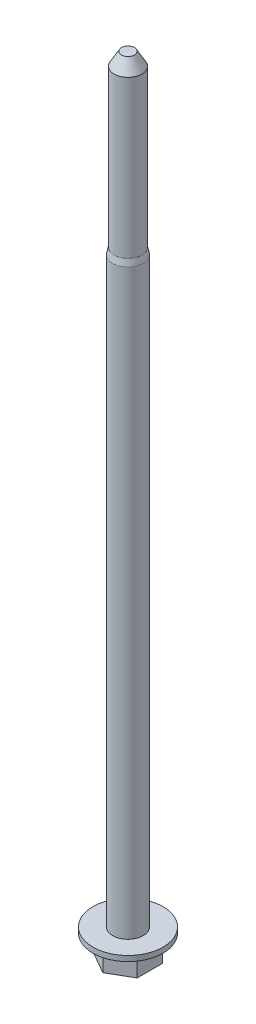
ISO-10303-21;
HEADER;
FILE_DESCRIPTION(('STEP AP214'),'2;1');
FILE_NAME('part.step','',(''),(''),'','','');
FILE_SCHEMA(('AUTOMOTIVE_DESIGN { 1 0 10303 214 1 1 1 1 }'));
ENDSEC;
DATA;
#1=APPLICATION_CONTEXT('core data for automotive mechanical design processes');
#2=APPLICATION_PROTOCOL_DEFINITION('international standard','automotive_design',2000,#1);
#3=PRODUCT_CONTEXT('',#1,'mechanical');
#4=PRODUCT('Part','Part','',(#3));
#5=PRODUCT_RELATED_PRODUCT_CATEGORY('part','',(#4));
#6=PRODUCT_DEFINITION_FORMATION('','',#4);
#7=PRODUCT_DEFINITION_CONTEXT('part definition',#1,'design');
#8=PRODUCT_DEFINITION('design','',#6,#7);
#9=PRODUCT_DEFINITION_SHAPE('','',#8);
#10=(LENGTH_UNIT() NAMED_UNIT(*) SI_UNIT(.MILLI.,.METRE.));
#11=(NAMED_UNIT(*) PLANE_ANGLE_UNIT() SI_UNIT($,.RADIAN.));
#12=(NAMED_UNIT(*) SI_UNIT($,.STERADIAN.) SOLID_ANGLE_UNIT());
#13=UNCERTAINTY_MEASURE_WITH_UNIT(LENGTH_MEASURE(1.E-05),#10,'distance_accuracy_value','');
#14=(GEOMETRIC_REPRESENTATION_CONTEXT(3) GLOBAL_UNCERTAINTY_ASSIGNED_CONTEXT((#13)) GLOBAL_UNIT_ASSIGNED_CONTEXT((#10,
#11,#12)) REPRESENTATION_CONTEXT('',''));
#15=CARTESIAN_POINT('',(0.,0.,0.));
#16=DIRECTION('',(0.,0.,1.));
#17=DIRECTION('',(1.,0.,0.));
#18=AXIS2_PLACEMENT_3D('',#15,#16,#17);
#19=CARTESIAN_POINT('',(0.,96.23,0.));
#20=DIRECTION('',(0.,1.,0.));
#21=DIRECTION('',(0.,0.,1.));
#22=AXIS2_PLACEMENT_3D('',#19,#20,#21);
#23=PLANE('',#22);
#24=CARTESIAN_POINT('',(0.,96.23,0.));
#25=DIRECTION('',(0.,1.,0.));
#26=DIRECTION('',(0.,0.,1.));
#27=AXIS2_PLACEMENT_3D('',#24,#25,#26);
#28=CIRCLE('',#27,2.17244343832996);
#29=CARTESIAN_POINT('',(0.,96.23,2.17244343832996));
#30=VERTEX_POINT('',#29);
#31=EDGE_CURVE('E41',#30,#30,#28,.T.);
#32=ORIENTED_EDGE('',*,*,#31,.T.);
#33=EDGE_LOOP('',(#32));
#34=FACE_BOUND('',#33,.T.);
#35=CARTESIAN_POINT('',(0.,96.23,0.));
#36=DIRECTION('',(0.,1.,0.));
#37=DIRECTION('',(0.,0.,1.));
#38=AXIS2_PLACEMENT_3D('',#35,#36,#37);
#39=CIRCLE('',#38,2.165);
#40=CARTESIAN_POINT('',(0.,96.23,2.165));
#41=VERTEX_POINT('',#40);
#42=EDGE_CURVE('E218',#41,#41,#39,.T.);
#43=ORIENTED_EDGE('',*,*,#42,.F.);
#44=EDGE_LOOP('',(#43));
#45=FACE_BOUND('',#44,.T.);
#46=ADVANCED_FACE('F32',(#34,#45),#23,.T.);
#47=CARTESIAN_POINT('',(0.,4.23,0.));
#48=DIRECTION('',(0.,1.,0.));
#49=DIRECTION('',(0.,0.,1.));
#50=AXIS2_PLACEMENT_3D('',#47,#48,#49);
#51=PLANE('',#50);
#52=CARTESIAN_POINT('',(0.,4.23,0.));
#53=DIRECTION('',(0.,1.,0.));
#54=DIRECTION('',(0.,0.,1.));
#55=AXIS2_PLACEMENT_3D('',#52,#53,#54);
#56=CIRCLE('',#55,5.48);
#57=CARTESIAN_POINT('',(0.,4.23,5.48));
#58=VERTEX_POINT('',#57);
#59=EDGE_CURVE('E130',#58,#58,#56,.T.);
#60=ORIENTED_EDGE('',*,*,#59,.T.);
#61=EDGE_LOOP('',(#60));
#62=FACE_BOUND('',#61,.T.);
#63=CARTESIAN_POINT('',(0.,4.23,0.));
#64=DIRECTION('',(0.,1.,0.));
#65=DIRECTION('',(0.,0.,1.));
#66=AXIS2_PLACEMENT_3D('',#63,#64,#65);
#67=CIRCLE('',#66,2.385);
#68=CARTESIAN_POINT('',(0.,4.23,2.385));
#69=VERTEX_POINT('',#68);
#70=EDGE_CURVE('E213',#69,#69,#67,.T.);
#71=ORIENTED_EDGE('',*,*,#70,.F.);
#72=EDGE_LOOP('',(#71));
#73=FACE_BOUND('',#72,.T.);
#74=ADVANCED_FACE('F163',(#62,#73),#51,.T.);
#75=CARTESIAN_POINT('',(-3.41000000000001,3.4,1.96876441793663));
#76=DIRECTION('',(0.5,0.,-0.866025403784439));
#77=DIRECTION('',(-0.866025403784439,0.,-0.5));
#78=AXIS2_PLACEMENT_3D('',#75,#76,#77);
#79=PLANE('',#78);
#80=DIRECTION('',(0.866025403784439,0.,0.5));
#81=VECTOR('',#80,1.);
#82=CARTESIAN_POINT('',(-3.41000000000001,0.,1.96876441793663));
#83=LINE('',#82,#81);
#84=CARTESIAN_POINT('',(-3.41000000000001,0.,1.96876441793663));
#85=VERTEX_POINT('',#84);
#86=CARTESIAN_POINT('',(0.,0.,3.93752883587325));
#87=VERTEX_POINT('',#86);
#88=EDGE_CURVE('E126',#85,#87,#83,.T.);
#89=ORIENTED_EDGE('',*,*,#88,.T.);
#90=DIRECTION('',(0.,-1.,0.));
#91=VECTOR('',#90,1.);
#92=CARTESIAN_POINT('',(0.,3.4,3.93752883587325));
#93=LINE('',#92,#91);
#94=CARTESIAN_POINT('',(0.,3.4,3.93752883587325));
#95=VERTEX_POINT('',#94);
#96=EDGE_CURVE('E141',#95,#87,#93,.T.);
#97=ORIENTED_EDGE('',*,*,#96,.F.);
#98=DIRECTION('',(0.866025403784439,0.,0.5));
#99=VECTOR('',#98,1.);
#100=CARTESIAN_POINT('',(-3.41000000000001,3.4,1.96876441793663));
#101=LINE('',#100,#99);
#102=CARTESIAN_POINT('',(-3.41000000000001,3.4,1.96876441793663));
#103=VERTEX_POINT('',#102);
#104=EDGE_CURVE('E118',#103,#95,#101,.T.);
#105=ORIENTED_EDGE('',*,*,#104,.F.);
#106=DIRECTION('',(0.,-1.,0.));
#107=VECTOR('',#106,1.);
#108=CARTESIAN_POINT('',(-3.41000000000001,3.4,1.96876441793663));
#109=LINE('',#108,#107);
#110=EDGE_CURVE('E125',#103,#85,#109,.T.);
#111=ORIENTED_EDGE('',*,*,#110,.T.);
#112=EDGE_LOOP('',(#89,#97,#105,#111));
#113=FACE_BOUND('',#112,.T.);
#114=ADVANCED_FACE('F168',(#113),#79,.F.);
#115=CARTESIAN_POINT('',(0.,3.4,3.93752883587325));
#116=DIRECTION('',(-0.5,0.,-0.866025403784438));
#117=DIRECTION('',(-0.866025403784438,0.,0.5));
#118=AXIS2_PLACEMENT_3D('',#115,#116,#117);
#119=PLANE('',#118);
#120=DIRECTION('',(0.866025403784438,0.,-0.5));
#121=VECTOR('',#120,1.);
#122=CARTESIAN_POINT('',(0.,0.,3.93752883587325));
#123=LINE('',#122,#121);
#124=CARTESIAN_POINT('',(3.41,0.,1.96876441793663));
#125=VERTEX_POINT('',#124);
#126=EDGE_CURVE('E129',#87,#125,#123,.T.);
#127=ORIENTED_EDGE('',*,*,#126,.T.);
#128=DIRECTION('',(0.,-1.,0.));
#129=VECTOR('',#128,1.);
#130=CARTESIAN_POINT('',(3.41,3.4,1.96876441793663));
#131=LINE('',#130,#129);
#132=CARTESIAN_POINT('',(3.41,3.4,1.96876441793663));
#133=VERTEX_POINT('',#132);
#134=EDGE_CURVE('E104',#133,#125,#131,.T.);
#135=ORIENTED_EDGE('',*,*,#134,.F.);
#136=DIRECTION('',(0.866025403784438,0.,-0.5));
#137=VECTOR('',#136,1.);
#138=CARTESIAN_POINT('',(0.,3.4,3.93752883587325));
#139=LINE('',#138,#137);
#140=EDGE_CURVE('E86',#95,#133,#139,.T.);
#141=ORIENTED_EDGE('',*,*,#140,.F.);
#142=ORIENTED_EDGE('',*,*,#96,.T.);
#143=EDGE_LOOP('',(#127,#135,#141,#142));
#144=FACE_BOUND('',#143,.T.);
#145=ADVANCED_FACE('F200',(#144),#119,.F.);
#146=CARTESIAN_POINT('',(3.41,3.4,1.96876441793663));
#147=DIRECTION('',(-1.,0.,0.));
#148=DIRECTION('',(0.,0.,1.));
#149=AXIS2_PLACEMENT_3D('',#146,#147,#148);
#150=PLANE('',#149);
#151=DIRECTION('',(0.,0.,-1.));
#152=VECTOR('',#151,1.);
#153=CARTESIAN_POINT('',(3.41,0.,1.96876441793663));
#154=LINE('',#153,#152);
#155=CARTESIAN_POINT('',(3.41,0.,-1.96876441793663));
#156=VERTEX_POINT('',#155);
#157=EDGE_CURVE('E101',#125,#156,#154,.T.);
#158=ORIENTED_EDGE('',*,*,#157,.T.);
#159=DIRECTION('',(0.,-1.,0.));
#160=VECTOR('',#159,1.);
#161=CARTESIAN_POINT('',(3.41,3.4,-1.96876441793663));
#162=LINE('',#161,#160);
#163=CARTESIAN_POINT('',(3.41,3.4,-1.96876441793663));
#164=VERTEX_POINT('',#163);
#165=EDGE_CURVE('E94',#164,#156,#162,.T.);
#166=ORIENTED_EDGE('',*,*,#165,.F.);
#167=DIRECTION('',(0.,0.,-1.));
#168=VECTOR('',#167,1.);
#169=CARTESIAN_POINT('',(3.41,3.4,1.96876441793663));
#170=LINE('',#169,#168);
#171=EDGE_CURVE('E99',#133,#164,#170,.T.);
#172=ORIENTED_EDGE('',*,*,#171,.F.);
#173=ORIENTED_EDGE('',*,*,#134,.T.);
#174=EDGE_LOOP('',(#158,#166,#172,#173));
#175=FACE_BOUND('',#174,.T.);
#176=ADVANCED_FACE('F96',(#175),#150,.F.);
#177=CARTESIAN_POINT('',(3.41,3.4,-1.96876441793663));
#178=DIRECTION('',(-0.5,0.,0.866025403784439));
#179=DIRECTION('',(0.866025403784439,0.,0.5));
#180=AXIS2_PLACEMENT_3D('',#177,#178,#179);
#181=PLANE('',#180);
#182=DIRECTION('',(-0.866025403784439,0.,-0.5));
#183=VECTOR('',#182,1.);
#184=CARTESIAN_POINT('',(3.41,0.,-1.96876441793663));
#185=LINE('',#184,#183);
#186=CARTESIAN_POINT('',(0.,0.,-3.93752883587326));
#187=VERTEX_POINT('',#186);
#188=EDGE_CURVE('E133',#156,#187,#185,.T.);
#189=ORIENTED_EDGE('',*,*,#188,.T.);
#190=DIRECTION('',(0.,-1.,0.));
#191=VECTOR('',#190,1.);
#192=CARTESIAN_POINT('',(0.,3.4,-3.93752883587326));
#193=LINE('',#192,#191);
#194=CARTESIAN_POINT('',(0.,3.4,-3.93752883587326));
#195=VERTEX_POINT('',#194);
#196=EDGE_CURVE('E105',#195,#187,#193,.T.);
#197=ORIENTED_EDGE('',*,*,#196,.F.);
#198=DIRECTION('',(-0.866025403784439,0.,-0.5));
#199=VECTOR('',#198,1.);
#200=CARTESIAN_POINT('',(3.41,3.4,-1.96876441793663));
#201=LINE('',#200,#199);
#202=EDGE_CURVE('E108',#164,#195,#201,.T.);
#203=ORIENTED_EDGE('',*,*,#202,.F.);
#204=ORIENTED_EDGE('',*,*,#165,.T.);
#205=EDGE_LOOP('',(#189,#197,#203,#204));
#206=FACE_BOUND('',#205,.T.);
#207=ADVANCED_FACE('F109',(#206),#181,.F.);
#208=CARTESIAN_POINT('',(0.,3.4,-3.93752883587326));
#209=DIRECTION('',(0.5,0.,0.866025403784439));
#210=DIRECTION('',(0.866025403784439,0.,-0.5));
#211=AXIS2_PLACEMENT_3D('',#208,#209,#210);
#212=PLANE('',#211);
#213=DIRECTION('',(-0.866025403784439,0.,0.5));
#214=VECTOR('',#213,1.);
#215=CARTESIAN_POINT('',(0.,0.,-3.93752883587326));
#216=LINE('',#215,#214);
#217=CARTESIAN_POINT('',(-3.41000000000001,0.,-1.96876441793663));
#218=VERTEX_POINT('',#217);
#219=EDGE_CURVE('E71',#187,#218,#216,.T.);
#220=ORIENTED_EDGE('',*,*,#219,.T.);
#221=DIRECTION('',(0.,-1.,0.));
#222=VECTOR('',#221,1.);
#223=CARTESIAN_POINT('',(-3.41000000000001,3.4,-1.96876441793663));
#224=LINE('',#223,#222);
#225=CARTESIAN_POINT('',(-3.41000000000001,3.4,-1.96876441793663));
#226=VERTEX_POINT('',#225);
#227=EDGE_CURVE('E49',#226,#218,#224,.T.);
#228=ORIENTED_EDGE('',*,*,#227,.F.);
#229=DIRECTION('',(-0.866025403784439,0.,0.5));
#230=VECTOR('',#229,1.);
#231=CARTESIAN_POINT('',(0.,3.4,-3.93752883587326));
#232=LINE('',#231,#230);
#233=EDGE_CURVE('E112',#195,#226,#232,.T.);
#234=ORIENTED_EDGE('',*,*,#233,.F.);
#235=ORIENTED_EDGE('',*,*,#196,.T.);
#236=EDGE_LOOP('',(#220,#228,#234,#235));
#237=FACE_BOUND('',#236,.T.);
#238=ADVANCED_FACE('F193',(#237),#212,.F.);
#239=CARTESIAN_POINT('',(-3.41000000000001,3.4,-1.96876441793663));
#240=DIRECTION('',(1.,0.,0.));
#241=DIRECTION('',(0.,0.,-1.));
#242=AXIS2_PLACEMENT_3D('',#239,#240,#241);
#243=PLANE('',#242);
#244=DIRECTION('',(0.,0.,1.));
#245=VECTOR('',#244,1.);
#246=CARTESIAN_POINT('',(-3.41000000000001,0.,-1.96876441793663));
#247=LINE('',#246,#245);
#248=EDGE_CURVE('E77',#218,#85,#247,.T.);
#249=ORIENTED_EDGE('',*,*,#248,.T.);
#250=ORIENTED_EDGE('',*,*,#110,.F.);
#251=DIRECTION('',(0.,0.,1.));
#252=VECTOR('',#251,1.);
#253=CARTESIAN_POINT('',(-3.41000000000001,3.4,-1.96876441793663));
#254=LINE('',#253,#252);
#255=EDGE_CURVE('E123',#226,#103,#254,.T.);
#256=ORIENTED_EDGE('',*,*,#255,.F.);
#257=ORIENTED_EDGE('',*,*,#227,.T.);
#258=EDGE_LOOP('',(#249,#250,#256,#257));
#259=FACE_BOUND('',#258,.T.);
#260=ADVANCED_FACE('F189',(#259),#243,.F.);
#261=CARTESIAN_POINT('',(0.,0.,0.));
#262=DIRECTION('',(0.,1.,0.));
#263=DIRECTION('',(0.,0.,1.));
#264=AXIS2_PLACEMENT_3D('',#261,#262,#263);
#265=PLANE('',#264);
#266=ORIENTED_EDGE('',*,*,#88,.F.);
#267=ORIENTED_EDGE('',*,*,#248,.F.);
#268=ORIENTED_EDGE('',*,*,#219,.F.);
#269=ORIENTED_EDGE('',*,*,#188,.F.);
#270=ORIENTED_EDGE('',*,*,#157,.F.);
#271=ORIENTED_EDGE('',*,*,#126,.F.);
#272=EDGE_LOOP('',(#266,#267,#268,#269,#270,#271));
#273=FACE_BOUND('',#272,.T.);
#274=ADVANCED_FACE('F182',(#273),#265,.F.);
#275=CARTESIAN_POINT('',(0.,3.4,0.));
#276=DIRECTION('',(0.,1.,0.));
#277=DIRECTION('',(0.,0.,1.));
#278=AXIS2_PLACEMENT_3D('',#275,#276,#277);
#279=PLANE('',#278);
#280=CARTESIAN_POINT('',(0.,3.4,0.));
#281=DIRECTION('',(0.,1.,0.));
#282=DIRECTION('',(0.,0.,1.));
#283=AXIS2_PLACEMENT_3D('',#280,#281,#282);
#284=CIRCLE('',#283,5.48);
#285=CARTESIAN_POINT('',(0.,3.4,5.48));
#286=VERTEX_POINT('',#285);
#287=EDGE_CURVE('E210',#286,#286,#284,.T.);
#288=ORIENTED_EDGE('',*,*,#287,.F.);
#289=EDGE_LOOP('',(#288));
#290=FACE_BOUND('',#289,.T.);
#291=ORIENTED_EDGE('',*,*,#255,.T.);
#292=ORIENTED_EDGE('',*,*,#104,.T.);
#293=ORIENTED_EDGE('',*,*,#140,.T.);
#294=ORIENTED_EDGE('',*,*,#171,.T.);
#295=ORIENTED_EDGE('',*,*,#202,.T.);
#296=ORIENTED_EDGE('',*,*,#233,.T.);
#297=EDGE_LOOP('',(#291,#292,#293,#294,#295,#296));
#298=FACE_BOUND('',#297,.T.);
#299=ADVANCED_FACE('F115',(#290,#298),#279,.F.);
#300=CARTESIAN_POINT('',(0.,4.23,0.));
#301=DIRECTION('',(0.,-1.,0.));
#302=DIRECTION('',(0.,0.,-1.));
#303=AXIS2_PLACEMENT_3D('',#300,#301,#302);
#304=CYLINDRICAL_SURFACE('',#303,5.48);
#305=ORIENTED_EDGE('',*,*,#59,.F.);
#306=EDGE_LOOP('',(#305));
#307=FACE_BOUND('',#306,.T.);
#308=ORIENTED_EDGE('',*,*,#287,.T.);
#309=EDGE_LOOP('',(#308));
#310=FACE_BOUND('',#309,.T.);
#311=ADVANCED_FACE('F177',(#307,#310),#304,.T.);
#312=CARTESIAN_POINT('',(0.,96.23,0.));
#313=DIRECTION('',(0.,-1.,0.));
#314=DIRECTION('',(0.,0.,-1.));
#315=AXIS2_PLACEMENT_3D('',#312,#313,#314);
#316=CYLINDRICAL_SURFACE('',#315,2.385);
#317=CARTESIAN_POINT('',(0.,95.2299999999999,0.));
#318=DIRECTION('',(0.,1.,0.));
#319=DIRECTION('',(0.,0.,1.));
#320=AXIS2_PLACEMENT_3D('',#317,#318,#319);
#321=CIRCLE('',#320,2.385);
#322=CARTESIAN_POINT('',(0.,95.2299999999999,2.385));
#323=VERTEX_POINT('',#322);
#324=EDGE_CURVE('E11',#323,#323,#321,.F.);
#325=ORIENTED_EDGE('',*,*,#324,.T.);
#326=EDGE_LOOP('',(#325));
#327=FACE_BOUND('',#326,.T.);
#328=ORIENTED_EDGE('',*,*,#70,.T.);
#329=EDGE_LOOP('',(#328));
#330=FACE_BOUND('',#329,.T.);
#331=ADVANCED_FACE('F175',(#327,#330),#316,.T.);
#332=CARTESIAN_POINT('',(0.,122.73,0.));
#333=DIRECTION('',(0.,-1.,0.));
#334=DIRECTION('',(0.,0.,-1.));
#335=AXIS2_PLACEMENT_3D('',#332,#333,#334);
#336=CYLINDRICAL_SURFACE('',#335,2.165);
#337=CARTESIAN_POINT('',(0.,120.73,0.));
#338=DIRECTION('',(0.,1.,0.));
#339=DIRECTION('',(0.,0.,1.));
#340=AXIS2_PLACEMENT_3D('',#337,#338,#339);
#341=CIRCLE('',#340,2.165);
#342=CARTESIAN_POINT('',(0.,120.73,2.165));
#343=VERTEX_POINT('',#342);
#344=EDGE_CURVE('E146',#343,#343,#341,.F.);
#345=ORIENTED_EDGE('',*,*,#344,.T.);
#346=EDGE_LOOP('',(#345));
#347=FACE_BOUND('',#346,.T.);
#348=ORIENTED_EDGE('',*,*,#42,.T.);
#349=EDGE_LOOP('',(#348));
#350=FACE_BOUND('',#349,.T.);
#351=ADVANCED_FACE('F173',(#347,#350),#336,.T.);
#352=CARTESIAN_POINT('',(0.,122.73,0.));
#353=DIRECTION('',(0.,1.,0.));
#354=DIRECTION('',(0.,0.,1.));
#355=AXIS2_PLACEMENT_3D('',#352,#353,#354);
#356=PLANE('',#355);
#357=CARTESIAN_POINT('',(0.,122.73,0.));
#358=DIRECTION('',(0.,1.,0.));
#359=DIRECTION('',(0.,0.,1.));
#360=AXIS2_PLACEMENT_3D('',#357,#358,#359);
#361=CIRCLE('',#360,1.01029946162075);
#362=CARTESIAN_POINT('',(0.,122.73,1.01029946162075));
#363=VERTEX_POINT('',#362);
#364=EDGE_CURVE('E143',#363,#363,#361,.T.);
#365=ORIENTED_EDGE('',*,*,#364,.T.);
#366=EDGE_LOOP('',(#365));
#367=FACE_BOUND('',#366,.T.);
#368=ADVANCED_FACE('F159',(#367),#356,.T.);
#369=CARTESIAN_POINT('',(0.,122.73,0.));
#370=DIRECTION('',(0.,-1.,0.));
#371=DIRECTION('',(0.,0.,-1.));
#372=AXIS2_PLACEMENT_3D('',#369,#370,#371);
#373=CONICAL_SURFACE('',#372,1.01029946162075,0.523598775598293);
#374=ORIENTED_EDGE('',*,*,#344,.F.);
#375=EDGE_LOOP('',(#374));
#376=FACE_BOUND('',#375,.T.);
#377=ORIENTED_EDGE('',*,*,#364,.F.);
#378=EDGE_LOOP('',(#377));
#379=FACE_BOUND('',#378,.T.);
#380=ADVANCED_FACE('F154',(#376,#379),#373,.T.);
#381=CARTESIAN_POINT('',(0.,96.23,0.));
#382=DIRECTION('',(0.,-1.,0.));
#383=DIRECTION('',(0.,0.,-1.));
#384=AXIS2_PLACEMENT_3D('',#381,#382,#383);
#385=CONICAL_SURFACE('',#384,2.17244343832996,0.209439510239316);
#386=ORIENTED_EDGE('',*,*,#324,.F.);
#387=EDGE_LOOP('',(#386));
#388=FACE_BOUND('',#387,.T.);
#389=ORIENTED_EDGE('',*,*,#31,.F.);
#390=EDGE_LOOP('',(#389));
#391=FACE_BOUND('',#390,.T.);
#392=ADVANCED_FACE('F34',(#388,#391),#385,.T.);
#393=CLOSED_SHELL('',(#46,#74,#114,#145,#176,#207,#238,#260,#274,#299,#311,#331,#351,#368,#380,#392));
#394=MANIFOLD_SOLID_BREP('B2',#393);
#395=ADVANCED_BREP_SHAPE_REPRESENTATION('',(#18,#394),#14);
#396=SHAPE_DEFINITION_REPRESENTATION(#9,#395);
ENDSEC;
END-ISO-10303-21;
